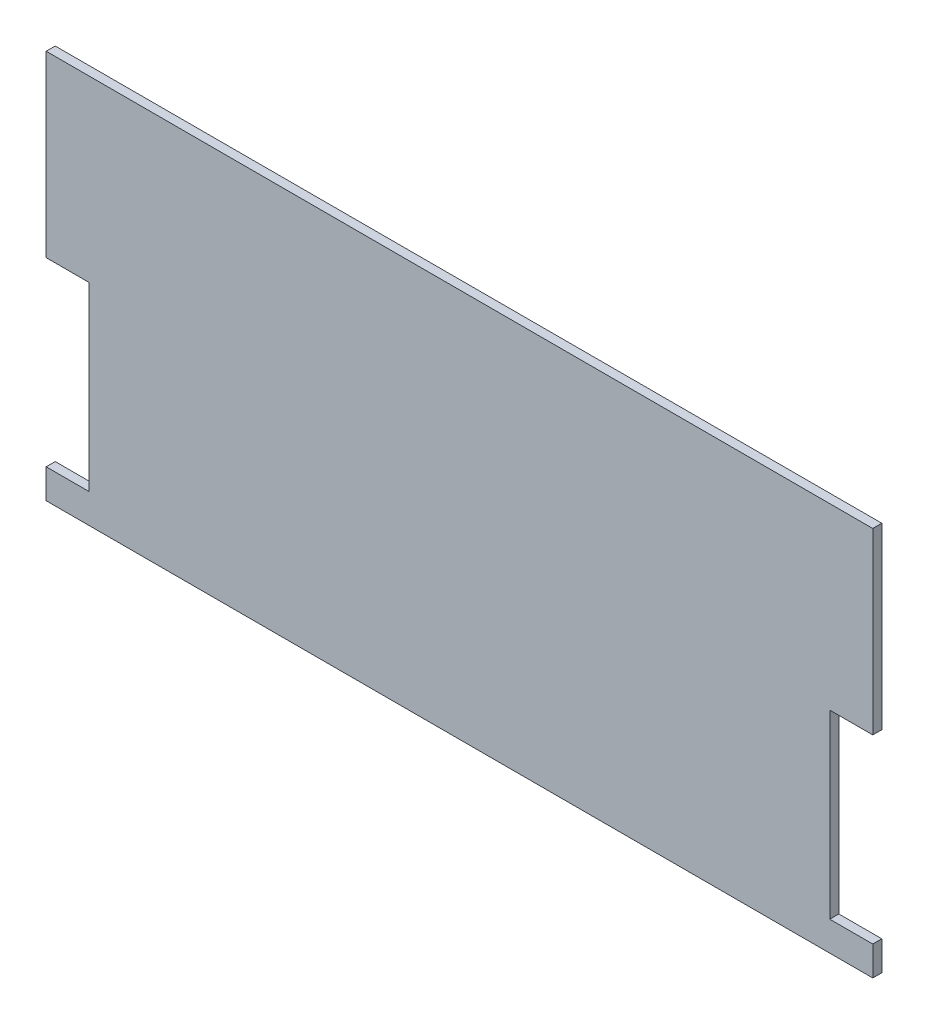
ISO-10303-21;
HEADER;
FILE_DESCRIPTION(('STEP AP214'),'2;1');
FILE_NAME('part.step','',(''),(''),'','','');
FILE_SCHEMA(('AUTOMOTIVE_DESIGN { 1 0 10303 214 1 1 1 1 }'));
ENDSEC;
DATA;
#1=APPLICATION_CONTEXT('core data for automotive mechanical design processes');
#2=APPLICATION_PROTOCOL_DEFINITION('international standard','automotive_design',2000,#1);
#3=PRODUCT_CONTEXT('',#1,'mechanical');
#4=PRODUCT('Part','Part','',(#3));
#5=PRODUCT_RELATED_PRODUCT_CATEGORY('part','',(#4));
#6=PRODUCT_DEFINITION_FORMATION('','',#4);
#7=PRODUCT_DEFINITION_CONTEXT('part definition',#1,'design');
#8=PRODUCT_DEFINITION('design','',#6,#7);
#9=PRODUCT_DEFINITION_SHAPE('','',#8);
#10=(LENGTH_UNIT() NAMED_UNIT(*) SI_UNIT(.MILLI.,.METRE.));
#11=(NAMED_UNIT(*) PLANE_ANGLE_UNIT() SI_UNIT($,.RADIAN.));
#12=(NAMED_UNIT(*) SI_UNIT($,.STERADIAN.) SOLID_ANGLE_UNIT());
#13=UNCERTAINTY_MEASURE_WITH_UNIT(LENGTH_MEASURE(1.E-05),#10,'distance_accuracy_value','');
#14=(GEOMETRIC_REPRESENTATION_CONTEXT(3) GLOBAL_UNCERTAINTY_ASSIGNED_CONTEXT((#13)) GLOBAL_UNIT_ASSIGNED_CONTEXT((#10,
#11,#12)) REPRESENTATION_CONTEXT('',''));
#15=CARTESIAN_POINT('',(0.,0.,0.));
#16=DIRECTION('',(0.,0.,1.));
#17=DIRECTION('',(1.,0.,0.));
#18=AXIS2_PLACEMENT_3D('',#15,#16,#17);
#19=CARTESIAN_POINT('',(0.,0.,2.));
#20=DIRECTION('',(1.,0.,0.));
#21=DIRECTION('',(0.,1.,0.));
#22=AXIS2_PLACEMENT_3D('',#19,#20,#21);
#23=PLANE('',#22);
#24=DIRECTION('',(0.,-1.,0.));
#25=VECTOR('',#24,1.);
#26=CARTESIAN_POINT('',(0.,0.,0.));
#27=LINE('',#26,#25);
#28=CARTESIAN_POINT('',(0.,0.,0.));
#29=VERTEX_POINT('',#28);
#30=CARTESIAN_POINT('',(0.,-39.5,0.));
#31=VERTEX_POINT('',#30);
#32=EDGE_CURVE('E170',#29,#31,#27,.T.);
#33=ORIENTED_EDGE('',*,*,#32,.T.);
#34=DIRECTION('',(0.,0.,-1.));
#35=VECTOR('',#34,1.);
#36=CARTESIAN_POINT('',(0.,-39.5,2.));
#37=LINE('',#36,#35);
#38=CARTESIAN_POINT('',(0.,-39.5,2.));
#39=VERTEX_POINT('',#38);
#40=EDGE_CURVE('E11',#39,#31,#37,.T.);
#41=ORIENTED_EDGE('',*,*,#40,.F.);
#42=DIRECTION('',(0.,-1.,0.));
#43=VECTOR('',#42,1.);
#44=CARTESIAN_POINT('',(0.,0.,2.));
#45=LINE('',#44,#43);
#46=CARTESIAN_POINT('',(0.,0.,2.));
#47=VERTEX_POINT('',#46);
#48=EDGE_CURVE('E204',#47,#39,#45,.T.);
#49=ORIENTED_EDGE('',*,*,#48,.F.);
#50=DIRECTION('',(0.,0.,-1.));
#51=VECTOR('',#50,1.);
#52=CARTESIAN_POINT('',(0.,0.,2.));
#53=LINE('',#52,#51);
#54=EDGE_CURVE('E166',#47,#29,#53,.T.);
#55=ORIENTED_EDGE('',*,*,#54,.T.);
#56=EDGE_LOOP('',(#33,#41,#49,#55));
#57=FACE_BOUND('',#56,.T.);
#58=ADVANCED_FACE('F43',(#57),#23,.F.);
#59=CARTESIAN_POINT('',(0.,-39.5,2.));
#60=DIRECTION('',(0.,1.,0.));
#61=DIRECTION('',(0.,0.,1.));
#62=AXIS2_PLACEMENT_3D('',#59,#60,#61);
#63=PLANE('',#62);
#64=DIRECTION('',(1.,0.,0.));
#65=VECTOR('',#64,1.);
#66=CARTESIAN_POINT('',(0.,-39.5,0.));
#67=LINE('',#66,#65);
#68=CARTESIAN_POINT('',(9.50000000000001,-39.5,0.));
#69=VERTEX_POINT('',#68);
#70=EDGE_CURVE('E174',#31,#69,#67,.T.);
#71=ORIENTED_EDGE('',*,*,#70,.T.);
#72=DIRECTION('',(0.,0.,-1.));
#73=VECTOR('',#72,1.);
#74=CARTESIAN_POINT('',(9.50000000000001,-39.5,2.));
#75=LINE('',#74,#73);
#76=CARTESIAN_POINT('',(9.50000000000001,-39.5,2.));
#77=VERTEX_POINT('',#76);
#78=EDGE_CURVE('E52',#77,#69,#75,.T.);
#79=ORIENTED_EDGE('',*,*,#78,.F.);
#80=DIRECTION('',(1.,0.,0.));
#81=VECTOR('',#80,1.);
#82=CARTESIAN_POINT('',(0.,-39.5,2.));
#83=LINE('',#82,#81);
#84=EDGE_CURVE('E115',#39,#77,#83,.T.);
#85=ORIENTED_EDGE('',*,*,#84,.F.);
#86=ORIENTED_EDGE('',*,*,#40,.T.);
#87=EDGE_LOOP('',(#71,#79,#85,#86));
#88=FACE_BOUND('',#87,.T.);
#89=ADVANCED_FACE('F280',(#88),#63,.F.);
#90=CARTESIAN_POINT('',(9.50000000000001,-39.5,2.));
#91=DIRECTION('',(1.,0.,0.));
#92=DIRECTION('',(0.,1.,0.));
#93=AXIS2_PLACEMENT_3D('',#90,#91,#92);
#94=PLANE('',#93);
#95=DIRECTION('',(0.,-1.,0.));
#96=VECTOR('',#95,1.);
#97=CARTESIAN_POINT('',(9.50000000000001,-39.5,0.));
#98=LINE('',#97,#96);
#99=CARTESIAN_POINT('',(9.50000000000001,-79.5,0.));
#100=VERTEX_POINT('',#99);
#101=EDGE_CURVE('E177',#69,#100,#98,.T.);
#102=ORIENTED_EDGE('',*,*,#101,.T.);
#103=DIRECTION('',(0.,0.,-1.));
#104=VECTOR('',#103,1.);
#105=CARTESIAN_POINT('',(9.50000000000001,-79.5,2.));
#106=LINE('',#105,#104);
#107=CARTESIAN_POINT('',(9.50000000000001,-79.5,2.));
#108=VERTEX_POINT('',#107);
#109=EDGE_CURVE('E229',#108,#100,#106,.T.);
#110=ORIENTED_EDGE('',*,*,#109,.F.);
#111=DIRECTION('',(0.,-1.,0.));
#112=VECTOR('',#111,1.);
#113=CARTESIAN_POINT('',(9.50000000000001,-39.5,2.));
#114=LINE('',#113,#112);
#115=EDGE_CURVE('E239',#77,#108,#114,.T.);
#116=ORIENTED_EDGE('',*,*,#115,.F.);
#117=ORIENTED_EDGE('',*,*,#78,.T.);
#118=EDGE_LOOP('',(#102,#110,#116,#117));
#119=FACE_BOUND('',#118,.T.);
#120=ADVANCED_FACE('F237',(#119),#94,.F.);
#121=CARTESIAN_POINT('',(0.,-79.5,2.));
#122=DIRECTION('',(0.,-1.,0.));
#123=DIRECTION('',(0.,0.,-1.));
#124=AXIS2_PLACEMENT_3D('',#121,#122,#123);
#125=PLANE('',#124);
#126=DIRECTION('',(-1.,0.,0.));
#127=VECTOR('',#126,1.);
#128=CARTESIAN_POINT('',(0.,-79.5,0.));
#129=LINE('',#128,#127);
#130=CARTESIAN_POINT('',(0.,-79.5,0.));
#131=VERTEX_POINT('',#130);
#132=EDGE_CURVE('E180',#100,#131,#129,.T.);
#133=ORIENTED_EDGE('',*,*,#132,.T.);
#134=DIRECTION('',(0.,0.,-1.));
#135=VECTOR('',#134,1.);
#136=CARTESIAN_POINT('',(0.,-79.5,2.));
#137=LINE('',#136,#135);
#138=CARTESIAN_POINT('',(0.,-79.5,2.));
#139=VERTEX_POINT('',#138);
#140=EDGE_CURVE('E226',#139,#131,#137,.T.);
#141=ORIENTED_EDGE('',*,*,#140,.F.);
#142=DIRECTION('',(-1.,0.,0.));
#143=VECTOR('',#142,1.);
#144=CARTESIAN_POINT('',(0.,-79.5,2.));
#145=LINE('',#144,#143);
#146=EDGE_CURVE('E258',#108,#139,#145,.T.);
#147=ORIENTED_EDGE('',*,*,#146,.F.);
#148=ORIENTED_EDGE('',*,*,#109,.T.);
#149=EDGE_LOOP('',(#133,#141,#147,#148));
#150=FACE_BOUND('',#149,.T.);
#151=ADVANCED_FACE('F248',(#150),#125,.F.);
#152=CARTESIAN_POINT('',(0.,-79.5,2.));
#153=DIRECTION('',(1.,0.,0.));
#154=DIRECTION('',(0.,1.,0.));
#155=AXIS2_PLACEMENT_3D('',#152,#153,#154);
#156=PLANE('',#155);
#157=DIRECTION('',(0.,-1.,0.));
#158=VECTOR('',#157,1.);
#159=CARTESIAN_POINT('',(0.,-79.5,0.));
#160=LINE('',#159,#158);
#161=CARTESIAN_POINT('',(0.,-86.,0.));
#162=VERTEX_POINT('',#161);
#163=EDGE_CURVE('E183',#131,#162,#160,.T.);
#164=ORIENTED_EDGE('',*,*,#163,.T.);
#165=DIRECTION('',(0.,0.,-1.));
#166=VECTOR('',#165,1.);
#167=CARTESIAN_POINT('',(0.,-86.,2.));
#168=LINE('',#167,#166);
#169=CARTESIAN_POINT('',(0.,-86.,2.));
#170=VERTEX_POINT('',#169);
#171=EDGE_CURVE('E222',#170,#162,#168,.T.);
#172=ORIENTED_EDGE('',*,*,#171,.F.);
#173=DIRECTION('',(0.,-1.,0.));
#174=VECTOR('',#173,1.);
#175=CARTESIAN_POINT('',(0.,-79.5,2.));
#176=LINE('',#175,#174);
#177=EDGE_CURVE('E254',#139,#170,#176,.T.);
#178=ORIENTED_EDGE('',*,*,#177,.F.);
#179=ORIENTED_EDGE('',*,*,#140,.T.);
#180=EDGE_LOOP('',(#164,#172,#178,#179));
#181=FACE_BOUND('',#180,.T.);
#182=ADVANCED_FACE('F252',(#181),#156,.F.);
#183=CARTESIAN_POINT('',(0.,-86.,2.));
#184=DIRECTION('',(0.,1.,0.));
#185=DIRECTION('',(0.,0.,1.));
#186=AXIS2_PLACEMENT_3D('',#183,#184,#185);
#187=PLANE('',#186);
#188=DIRECTION('',(1.,0.,0.));
#189=VECTOR('',#188,1.);
#190=CARTESIAN_POINT('',(0.,-86.,0.));
#191=LINE('',#190,#189);
#192=CARTESIAN_POINT('',(182.6,-86.,0.));
#193=VERTEX_POINT('',#192);
#194=EDGE_CURVE('E186',#162,#193,#191,.T.);
#195=ORIENTED_EDGE('',*,*,#194,.T.);
#196=DIRECTION('',(0.,0.,-1.));
#197=VECTOR('',#196,1.);
#198=CARTESIAN_POINT('',(182.6,-86.,2.));
#199=LINE('',#198,#197);
#200=CARTESIAN_POINT('',(182.6,-86.,2.));
#201=VERTEX_POINT('',#200);
#202=EDGE_CURVE('E218',#201,#193,#199,.T.);
#203=ORIENTED_EDGE('',*,*,#202,.F.);
#204=DIRECTION('',(1.,0.,0.));
#205=VECTOR('',#204,1.);
#206=CARTESIAN_POINT('',(0.,-86.,2.));
#207=LINE('',#206,#205);
#208=EDGE_CURVE('E257',#170,#201,#207,.T.);
#209=ORIENTED_EDGE('',*,*,#208,.F.);
#210=ORIENTED_EDGE('',*,*,#171,.T.);
#211=EDGE_LOOP('',(#195,#203,#209,#210));
#212=FACE_BOUND('',#211,.T.);
#213=ADVANCED_FACE('F292',(#212),#187,.F.);
#214=CARTESIAN_POINT('',(182.6,-79.5,2.));
#215=DIRECTION('',(-1.,0.,0.));
#216=DIRECTION('',(0.,0.,1.));
#217=AXIS2_PLACEMENT_3D('',#214,#215,#216);
#218=PLANE('',#217);
#219=DIRECTION('',(0.,1.,0.));
#220=VECTOR('',#219,1.);
#221=CARTESIAN_POINT('',(182.6,-79.5,0.));
#222=LINE('',#221,#220);
#223=CARTESIAN_POINT('',(182.6,-79.5,0.));
#224=VERTEX_POINT('',#223);
#225=EDGE_CURVE('E189',#193,#224,#222,.T.);
#226=ORIENTED_EDGE('',*,*,#225,.T.);
#227=DIRECTION('',(0.,0.,-1.));
#228=VECTOR('',#227,1.);
#229=CARTESIAN_POINT('',(182.6,-79.5,2.));
#230=LINE('',#229,#228);
#231=CARTESIAN_POINT('',(182.6,-79.5,2.));
#232=VERTEX_POINT('',#231);
#233=EDGE_CURVE('E215',#232,#224,#230,.T.);
#234=ORIENTED_EDGE('',*,*,#233,.F.);
#235=DIRECTION('',(0.,1.,0.));
#236=VECTOR('',#235,1.);
#237=CARTESIAN_POINT('',(182.6,-79.5,2.));
#238=LINE('',#237,#236);
#239=EDGE_CURVE('E262',#201,#232,#238,.T.);
#240=ORIENTED_EDGE('',*,*,#239,.F.);
#241=ORIENTED_EDGE('',*,*,#202,.T.);
#242=EDGE_LOOP('',(#226,#234,#240,#241));
#243=FACE_BOUND('',#242,.T.);
#244=ADVANCED_FACE('F295',(#243),#218,.F.);
#245=CARTESIAN_POINT('',(182.6,-79.5,2.));
#246=DIRECTION('',(0.,-1.,0.));
#247=DIRECTION('',(0.,0.,-1.));
#248=AXIS2_PLACEMENT_3D('',#245,#246,#247);
#249=PLANE('',#248);
#250=DIRECTION('',(-1.,0.,0.));
#251=VECTOR('',#250,1.);
#252=CARTESIAN_POINT('',(182.6,-79.5,0.));
#253=LINE('',#252,#251);
#254=CARTESIAN_POINT('',(173.1,-79.5,0.));
#255=VERTEX_POINT('',#254);
#256=EDGE_CURVE('E192',#224,#255,#253,.T.);
#257=ORIENTED_EDGE('',*,*,#256,.T.);
#258=DIRECTION('',(0.,0.,-1.));
#259=VECTOR('',#258,1.);
#260=CARTESIAN_POINT('',(173.1,-79.5,2.));
#261=LINE('',#260,#259);
#262=CARTESIAN_POINT('',(173.1,-79.5,2.));
#263=VERTEX_POINT('',#262);
#264=EDGE_CURVE('E211',#263,#255,#261,.T.);
#265=ORIENTED_EDGE('',*,*,#264,.F.);
#266=DIRECTION('',(-1.,0.,0.));
#267=VECTOR('',#266,1.);
#268=CARTESIAN_POINT('',(182.6,-79.5,2.));
#269=LINE('',#268,#267);
#270=EDGE_CURVE('E269',#232,#263,#269,.T.);
#271=ORIENTED_EDGE('',*,*,#270,.F.);
#272=ORIENTED_EDGE('',*,*,#233,.T.);
#273=EDGE_LOOP('',(#257,#265,#271,#272));
#274=FACE_BOUND('',#273,.T.);
#275=ADVANCED_FACE('F299',(#274),#249,.F.);
#276=CARTESIAN_POINT('',(173.1,-39.5,2.));
#277=DIRECTION('',(-1.,0.,0.));
#278=DIRECTION('',(0.,0.,1.));
#279=AXIS2_PLACEMENT_3D('',#276,#277,#278);
#280=PLANE('',#279);
#281=DIRECTION('',(0.,1.,0.));
#282=VECTOR('',#281,1.);
#283=CARTESIAN_POINT('',(173.1,-39.5,0.));
#284=LINE('',#283,#282);
#285=CARTESIAN_POINT('',(173.1,-39.5,0.));
#286=VERTEX_POINT('',#285);
#287=EDGE_CURVE('E195',#255,#286,#284,.T.);
#288=ORIENTED_EDGE('',*,*,#287,.T.);
#289=DIRECTION('',(0.,0.,-1.));
#290=VECTOR('',#289,1.);
#291=CARTESIAN_POINT('',(173.1,-39.5,2.));
#292=LINE('',#291,#290);
#293=CARTESIAN_POINT('',(173.1,-39.5,2.));
#294=VERTEX_POINT('',#293);
#295=EDGE_CURVE('E157',#294,#286,#292,.T.);
#296=ORIENTED_EDGE('',*,*,#295,.F.);
#297=DIRECTION('',(0.,1.,0.));
#298=VECTOR('',#297,1.);
#299=CARTESIAN_POINT('',(173.1,-39.5,2.));
#300=LINE('',#299,#298);
#301=EDGE_CURVE('E146',#263,#294,#300,.T.);
#302=ORIENTED_EDGE('',*,*,#301,.F.);
#303=ORIENTED_EDGE('',*,*,#264,.T.);
#304=EDGE_LOOP('',(#288,#296,#302,#303));
#305=FACE_BOUND('',#304,.T.);
#306=ADVANCED_FACE('F303',(#305),#280,.F.);
#307=CARTESIAN_POINT('',(182.6,-39.5,2.));
#308=DIRECTION('',(0.,1.,0.));
#309=DIRECTION('',(0.,0.,1.));
#310=AXIS2_PLACEMENT_3D('',#307,#308,#309);
#311=PLANE('',#310);
#312=DIRECTION('',(1.,0.,0.));
#313=VECTOR('',#312,1.);
#314=CARTESIAN_POINT('',(182.6,-39.5,0.));
#315=LINE('',#314,#313);
#316=CARTESIAN_POINT('',(182.6,-39.5,0.));
#317=VERTEX_POINT('',#316);
#318=EDGE_CURVE('E155',#286,#317,#315,.T.);
#319=ORIENTED_EDGE('',*,*,#318,.T.);
#320=DIRECTION('',(0.,0.,-1.));
#321=VECTOR('',#320,1.);
#322=CARTESIAN_POINT('',(182.6,-39.5,2.));
#323=LINE('',#322,#321);
#324=CARTESIAN_POINT('',(182.6,-39.5,2.));
#325=VERTEX_POINT('',#324);
#326=EDGE_CURVE('E152',#325,#317,#323,.T.);
#327=ORIENTED_EDGE('',*,*,#326,.F.);
#328=DIRECTION('',(1.,0.,0.));
#329=VECTOR('',#328,1.);
#330=CARTESIAN_POINT('',(182.6,-39.5,2.));
#331=LINE('',#330,#329);
#332=EDGE_CURVE('E140',#294,#325,#331,.T.);
#333=ORIENTED_EDGE('',*,*,#332,.F.);
#334=ORIENTED_EDGE('',*,*,#295,.T.);
#335=EDGE_LOOP('',(#319,#327,#333,#334));
#336=FACE_BOUND('',#335,.T.);
#337=ADVANCED_FACE('F153',(#336),#311,.F.);
#338=CARTESIAN_POINT('',(182.6,0.,2.));
#339=DIRECTION('',(-1.,0.,0.));
#340=DIRECTION('',(0.,0.,1.));
#341=AXIS2_PLACEMENT_3D('',#338,#339,#340);
#342=PLANE('',#341);
#343=DIRECTION('',(0.,1.,0.));
#344=VECTOR('',#343,1.);
#345=CARTESIAN_POINT('',(182.6,0.,0.));
#346=LINE('',#345,#344);
#347=CARTESIAN_POINT('',(182.6,0.,0.));
#348=VERTEX_POINT('',#347);
#349=EDGE_CURVE('E101',#317,#348,#346,.T.);
#350=ORIENTED_EDGE('',*,*,#349,.T.);
#351=DIRECTION('',(0.,0.,-1.));
#352=VECTOR('',#351,1.);
#353=CARTESIAN_POINT('',(182.6,0.,2.));
#354=LINE('',#353,#352);
#355=CARTESIAN_POINT('',(182.6,0.,2.));
#356=VERTEX_POINT('',#355);
#357=EDGE_CURVE('E158',#356,#348,#354,.T.);
#358=ORIENTED_EDGE('',*,*,#357,.F.);
#359=DIRECTION('',(0.,1.,0.));
#360=VECTOR('',#359,1.);
#361=CARTESIAN_POINT('',(182.6,0.,2.));
#362=LINE('',#361,#360);
#363=EDGE_CURVE('E144',#325,#356,#362,.T.);
#364=ORIENTED_EDGE('',*,*,#363,.F.);
#365=ORIENTED_EDGE('',*,*,#326,.T.);
#366=EDGE_LOOP('',(#350,#358,#364,#365));
#367=FACE_BOUND('',#366,.T.);
#368=ADVANCED_FACE('F160',(#367),#342,.F.);
#369=CARTESIAN_POINT('',(0.,0.,2.));
#370=DIRECTION('',(0.,-1.,0.));
#371=DIRECTION('',(0.,0.,-1.));
#372=AXIS2_PLACEMENT_3D('',#369,#370,#371);
#373=PLANE('',#372);
#374=DIRECTION('',(-1.,0.,0.));
#375=VECTOR('',#374,1.);
#376=CARTESIAN_POINT('',(0.,0.,0.));
#377=LINE('',#376,#375);
#378=EDGE_CURVE('E107',#348,#29,#377,.T.);
#379=ORIENTED_EDGE('',*,*,#378,.T.);
#380=ORIENTED_EDGE('',*,*,#54,.F.);
#381=DIRECTION('',(-1.,0.,0.));
#382=VECTOR('',#381,1.);
#383=CARTESIAN_POINT('',(0.,0.,2.));
#384=LINE('',#383,#382);
#385=EDGE_CURVE('E60',#356,#47,#384,.T.);
#386=ORIENTED_EDGE('',*,*,#385,.F.);
#387=ORIENTED_EDGE('',*,*,#357,.T.);
#388=EDGE_LOOP('',(#379,#380,#386,#387));
#389=FACE_BOUND('',#388,.T.);
#390=ADVANCED_FACE('F312',(#389),#373,.F.);
#391=CARTESIAN_POINT('',(0.,0.,2.));
#392=DIRECTION('',(0.,0.,1.));
#393=DIRECTION('',(1.,0.,0.));
#394=AXIS2_PLACEMENT_3D('',#391,#392,#393);
#395=PLANE('',#394);
#396=ORIENTED_EDGE('',*,*,#48,.T.);
#397=ORIENTED_EDGE('',*,*,#84,.T.);
#398=ORIENTED_EDGE('',*,*,#115,.T.);
#399=ORIENTED_EDGE('',*,*,#146,.T.);
#400=ORIENTED_EDGE('',*,*,#177,.T.);
#401=ORIENTED_EDGE('',*,*,#208,.T.);
#402=ORIENTED_EDGE('',*,*,#239,.T.);
#403=ORIENTED_EDGE('',*,*,#270,.T.);
#404=ORIENTED_EDGE('',*,*,#301,.T.);
#405=ORIENTED_EDGE('',*,*,#332,.T.);
#406=ORIENTED_EDGE('',*,*,#363,.T.);
#407=ORIENTED_EDGE('',*,*,#385,.T.);
#408=EDGE_LOOP('',(#396,#397,#398,#399,#400,#401,#402,#403,#404,#405,#406,#407));
#409=FACE_BOUND('',#408,.T.);
#410=ADVANCED_FACE('F142',(#409),#395,.T.);
#411=CARTESIAN_POINT('',(0.,0.,0.));
#412=DIRECTION('',(0.,0.,1.));
#413=DIRECTION('',(1.,0.,0.));
#414=AXIS2_PLACEMENT_3D('',#411,#412,#413);
#415=PLANE('',#414);
#416=ORIENTED_EDGE('',*,*,#32,.F.);
#417=ORIENTED_EDGE('',*,*,#378,.F.);
#418=ORIENTED_EDGE('',*,*,#349,.F.);
#419=ORIENTED_EDGE('',*,*,#318,.F.);
#420=ORIENTED_EDGE('',*,*,#287,.F.);
#421=ORIENTED_EDGE('',*,*,#256,.F.);
#422=ORIENTED_EDGE('',*,*,#225,.F.);
#423=ORIENTED_EDGE('',*,*,#194,.F.);
#424=ORIENTED_EDGE('',*,*,#163,.F.);
#425=ORIENTED_EDGE('',*,*,#132,.F.);
#426=ORIENTED_EDGE('',*,*,#101,.F.);
#427=ORIENTED_EDGE('',*,*,#70,.F.);
#428=EDGE_LOOP('',(#416,#417,#418,#419,#420,#421,#422,#423,#424,#425,#426,#427));
#429=FACE_BOUND('',#428,.T.);
#430=ADVANCED_FACE('F243',(#429),#415,.F.);
#431=CLOSED_SHELL('',(#58,#89,#120,#151,#182,#213,#244,#275,#306,#337,#368,#390,#410,#430));
#432=MANIFOLD_SOLID_BREP('B2',#431);
#433=ADVANCED_BREP_SHAPE_REPRESENTATION('',(#18,#432),#14);
#434=SHAPE_DEFINITION_REPRESENTATION(#9,#433);
ENDSEC;
END-ISO-10303-21;
